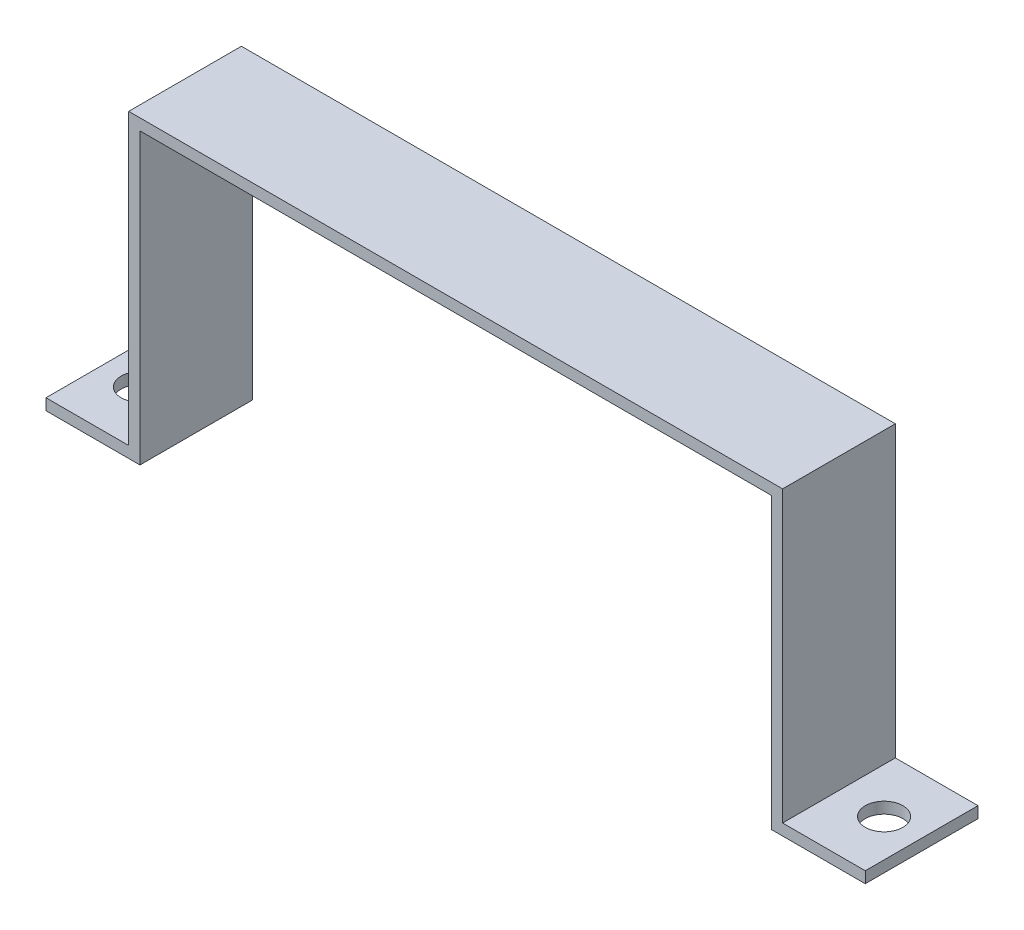
ISO-10303-21;
HEADER;
FILE_DESCRIPTION(('STEP AP214'),'2;1');
FILE_NAME('part.step','',(''),(''),'','','');
FILE_SCHEMA(('AUTOMOTIVE_DESIGN { 1 0 10303 214 1 1 1 1 }'));
ENDSEC;
DATA;
#1=APPLICATION_CONTEXT('core data for automotive mechanical design processes');
#2=APPLICATION_PROTOCOL_DEFINITION('international standard','automotive_design',2000,#1);
#3=PRODUCT_CONTEXT('',#1,'mechanical');
#4=PRODUCT('Part','Part','',(#3));
#5=PRODUCT_RELATED_PRODUCT_CATEGORY('part','',(#4));
#6=PRODUCT_DEFINITION_FORMATION('','',#4);
#7=PRODUCT_DEFINITION_CONTEXT('part definition',#1,'design');
#8=PRODUCT_DEFINITION('design','',#6,#7);
#9=PRODUCT_DEFINITION_SHAPE('','',#8);
#10=(LENGTH_UNIT() NAMED_UNIT(*) SI_UNIT(.MILLI.,.METRE.));
#11=(NAMED_UNIT(*) PLANE_ANGLE_UNIT() SI_UNIT($,.RADIAN.));
#12=(NAMED_UNIT(*) SI_UNIT($,.STERADIAN.) SOLID_ANGLE_UNIT());
#13=UNCERTAINTY_MEASURE_WITH_UNIT(LENGTH_MEASURE(1.E-05),#10,'distance_accuracy_value','');
#14=(GEOMETRIC_REPRESENTATION_CONTEXT(3) GLOBAL_UNCERTAINTY_ASSIGNED_CONTEXT((#13)) GLOBAL_UNIT_ASSIGNED_CONTEXT((#10,
#11,#12)) REPRESENTATION_CONTEXT('',''));
#15=CARTESIAN_POINT('',(0.,0.,0.));
#16=DIRECTION('',(0.,0.,1.));
#17=DIRECTION('',(1.,0.,0.));
#18=AXIS2_PLACEMENT_3D('',#15,#16,#17);
#19=CARTESIAN_POINT('',(-109.,0.,30.));
#20=DIRECTION('',(0.,1.,0.));
#21=DIRECTION('',(0.,0.,1.));
#22=AXIS2_PLACEMENT_3D('',#19,#20,#21);
#23=PLANE('',#22);
#24=CARTESIAN_POINT('',(-99.,0.,15.));
#25=DIRECTION('',(0.,1.,0.));
#26=DIRECTION('',(0.,0.,1.));
#27=AXIS2_PLACEMENT_3D('',#24,#25,#26);
#28=CIRCLE('',#27,5.);
#29=CARTESIAN_POINT('',(-99.,0.,20.));
#30=VERTEX_POINT('',#29);
#31=EDGE_CURVE('E266',#30,#30,#28,.T.);
#32=ORIENTED_EDGE('',*,*,#31,.T.);
#33=EDGE_LOOP('',(#32));
#34=FACE_BOUND('',#33,.T.);
#35=DIRECTION('',(1.,0.,0.));
#36=VECTOR('',#35,1.);
#37=CARTESIAN_POINT('',(-109.,0.,0.));
#38=LINE('',#37,#36);
#39=CARTESIAN_POINT('',(-109.,0.,0.));
#40=VERTEX_POINT('',#39);
#41=CARTESIAN_POINT('',(-84.,0.,0.));
#42=VERTEX_POINT('',#41);
#43=EDGE_CURVE('E157',#40,#42,#38,.T.);
#44=ORIENTED_EDGE('',*,*,#43,.T.);
#45=DIRECTION('',(0.,0.,-1.));
#46=VECTOR('',#45,1.);
#47=CARTESIAN_POINT('',(-84.,0.,30.));
#48=LINE('',#47,#46);
#49=CARTESIAN_POINT('',(-84.,0.,30.));
#50=VERTEX_POINT('',#49);
#51=EDGE_CURVE('E11',#50,#42,#48,.T.);
#52=ORIENTED_EDGE('',*,*,#51,.F.);
#53=DIRECTION('',(1.,0.,0.));
#54=VECTOR('',#53,1.);
#55=CARTESIAN_POINT('',(-109.,0.,30.));
#56=LINE('',#55,#54);
#57=CARTESIAN_POINT('',(-109.,0.,30.));
#58=VERTEX_POINT('',#57);
#59=EDGE_CURVE('E180',#58,#50,#56,.T.);
#60=ORIENTED_EDGE('',*,*,#59,.F.);
#61=DIRECTION('',(0.,0.,-1.));
#62=VECTOR('',#61,1.);
#63=CARTESIAN_POINT('',(-109.,0.,30.));
#64=LINE('',#63,#62);
#65=EDGE_CURVE('E153',#58,#40,#64,.T.);
#66=ORIENTED_EDGE('',*,*,#65,.T.);
#67=EDGE_LOOP('',(#44,#52,#60,#66));
#68=FACE_BOUND('',#67,.T.);
#69=ADVANCED_FACE('F37',(#34,#68),#23,.F.);
#70=CARTESIAN_POINT('',(-84.,0.,30.));
#71=DIRECTION('',(-1.,0.,0.));
#72=DIRECTION('',(0.,0.,1.));
#73=AXIS2_PLACEMENT_3D('',#70,#71,#72);
#74=PLANE('',#73);
#75=DIRECTION('',(0.,1.,0.));
#76=VECTOR('',#75,1.);
#77=CARTESIAN_POINT('',(-84.,0.,0.));
#78=LINE('',#77,#76);
#79=CARTESIAN_POINT('',(-84.,77.,0.));
#80=VERTEX_POINT('',#79);
#81=EDGE_CURVE('E160',#42,#80,#78,.T.);
#82=ORIENTED_EDGE('',*,*,#81,.T.);
#83=DIRECTION('',(0.,0.,-1.));
#84=VECTOR('',#83,1.);
#85=CARTESIAN_POINT('',(-84.,77.,30.));
#86=LINE('',#85,#84);
#87=CARTESIAN_POINT('',(-84.,77.,30.));
#88=VERTEX_POINT('',#87);
#89=EDGE_CURVE('E45',#88,#80,#86,.T.);
#90=ORIENTED_EDGE('',*,*,#89,.F.);
#91=DIRECTION('',(0.,1.,0.));
#92=VECTOR('',#91,1.);
#93=CARTESIAN_POINT('',(-84.,0.,30.));
#94=LINE('',#93,#92);
#95=EDGE_CURVE('E108',#50,#88,#94,.T.);
#96=ORIENTED_EDGE('',*,*,#95,.F.);
#97=ORIENTED_EDGE('',*,*,#51,.T.);
#98=EDGE_LOOP('',(#82,#90,#96,#97));
#99=FACE_BOUND('',#98,.T.);
#100=ADVANCED_FACE('F259',(#99),#74,.F.);
#101=CARTESIAN_POINT('',(-84.,77.,30.));
#102=DIRECTION('',(0.,1.,0.));
#103=DIRECTION('',(0.,0.,1.));
#104=AXIS2_PLACEMENT_3D('',#101,#102,#103);
#105=PLANE('',#104);
#106=DIRECTION('',(1.,0.,0.));
#107=VECTOR('',#106,1.);
#108=CARTESIAN_POINT('',(-84.,77.,0.));
#109=LINE('',#108,#107);
#110=CARTESIAN_POINT('',(84.,77.,0.));
#111=VERTEX_POINT('',#110);
#112=EDGE_CURVE('E163',#80,#111,#109,.T.);
#113=ORIENTED_EDGE('',*,*,#112,.T.);
#114=DIRECTION('',(0.,0.,-1.));
#115=VECTOR('',#114,1.);
#116=CARTESIAN_POINT('',(84.,77.,30.));
#117=LINE('',#116,#115);
#118=CARTESIAN_POINT('',(84.,77.,30.));
#119=VERTEX_POINT('',#118);
#120=EDGE_CURVE('E199',#119,#111,#117,.T.);
#121=ORIENTED_EDGE('',*,*,#120,.F.);
#122=DIRECTION('',(1.,0.,0.));
#123=VECTOR('',#122,1.);
#124=CARTESIAN_POINT('',(-84.,77.,30.));
#125=LINE('',#124,#123);
#126=EDGE_CURVE('E207',#88,#119,#125,.T.);
#127=ORIENTED_EDGE('',*,*,#126,.F.);
#128=ORIENTED_EDGE('',*,*,#89,.T.);
#129=EDGE_LOOP('',(#113,#121,#127,#128));
#130=FACE_BOUND('',#129,.T.);
#131=ADVANCED_FACE('F205',(#130),#105,.F.);
#132=CARTESIAN_POINT('',(84.,77.,30.));
#133=DIRECTION('',(1.,0.,0.));
#134=DIRECTION('',(0.,1.,0.));
#135=AXIS2_PLACEMENT_3D('',#132,#133,#134);
#136=PLANE('',#135);
#137=DIRECTION('',(0.,-1.,0.));
#138=VECTOR('',#137,1.);
#139=CARTESIAN_POINT('',(84.,77.,0.));
#140=LINE('',#139,#138);
#141=CARTESIAN_POINT('',(84.,0.,0.));
#142=VERTEX_POINT('',#141);
#143=EDGE_CURVE('E165',#111,#142,#140,.T.);
#144=ORIENTED_EDGE('',*,*,#143,.T.);
#145=DIRECTION('',(0.,0.,-1.));
#146=VECTOR('',#145,1.);
#147=CARTESIAN_POINT('',(84.,0.,30.));
#148=LINE('',#147,#146);
#149=CARTESIAN_POINT('',(84.,0.,30.));
#150=VERTEX_POINT('',#149);
#151=EDGE_CURVE('E196',#150,#142,#148,.T.);
#152=ORIENTED_EDGE('',*,*,#151,.F.);
#153=DIRECTION('',(0.,-1.,0.));
#154=VECTOR('',#153,1.);
#155=CARTESIAN_POINT('',(84.,77.,30.));
#156=LINE('',#155,#154);
#157=EDGE_CURVE('E225',#119,#150,#156,.T.);
#158=ORIENTED_EDGE('',*,*,#157,.F.);
#159=ORIENTED_EDGE('',*,*,#120,.T.);
#160=EDGE_LOOP('',(#144,#152,#158,#159));
#161=FACE_BOUND('',#160,.T.);
#162=ADVANCED_FACE('F216',(#161),#136,.F.);
#163=CARTESIAN_POINT('',(84.,0.,30.));
#164=DIRECTION('',(0.,1.,0.));
#165=DIRECTION('',(0.,0.,1.));
#166=AXIS2_PLACEMENT_3D('',#163,#164,#165);
#167=PLANE('',#166);
#168=CARTESIAN_POINT('',(99.,0.,15.));
#169=DIRECTION('',(0.,1.,0.));
#170=DIRECTION('',(0.,0.,1.));
#171=AXIS2_PLACEMENT_3D('',#168,#169,#170);
#172=CIRCLE('',#171,5.00000000000002);
#173=CARTESIAN_POINT('',(99.,0.,20.));
#174=VERTEX_POINT('',#173);
#175=EDGE_CURVE('E161',#174,#174,#172,.T.);
#176=ORIENTED_EDGE('',*,*,#175,.T.);
#177=EDGE_LOOP('',(#176));
#178=FACE_BOUND('',#177,.T.);
#179=DIRECTION('',(1.,0.,0.));
#180=VECTOR('',#179,1.);
#181=CARTESIAN_POINT('',(84.,0.,0.));
#182=LINE('',#181,#180);
#183=CARTESIAN_POINT('',(109.,0.,0.));
#184=VERTEX_POINT('',#183);
#185=EDGE_CURVE('E167',#142,#184,#182,.T.);
#186=ORIENTED_EDGE('',*,*,#185,.T.);
#187=DIRECTION('',(0.,0.,-1.));
#188=VECTOR('',#187,1.);
#189=CARTESIAN_POINT('',(109.,0.,30.));
#190=LINE('',#189,#188);
#191=CARTESIAN_POINT('',(109.,0.,30.));
#192=VERTEX_POINT('',#191);
#193=EDGE_CURVE('E193',#192,#184,#190,.T.);
#194=ORIENTED_EDGE('',*,*,#193,.F.);
#195=DIRECTION('',(1.,0.,0.));
#196=VECTOR('',#195,1.);
#197=CARTESIAN_POINT('',(84.,0.,30.));
#198=LINE('',#197,#196);
#199=EDGE_CURVE('E222',#150,#192,#198,.T.);
#200=ORIENTED_EDGE('',*,*,#199,.F.);
#201=ORIENTED_EDGE('',*,*,#151,.T.);
#202=EDGE_LOOP('',(#186,#194,#200,#201));
#203=FACE_BOUND('',#202,.T.);
#204=ADVANCED_FACE('F220',(#178,#203),#167,.F.);
#205=CARTESIAN_POINT('',(109.,0.,30.));
#206=DIRECTION('',(-1.,0.,0.));
#207=DIRECTION('',(0.,0.,1.));
#208=AXIS2_PLACEMENT_3D('',#205,#206,#207);
#209=PLANE('',#208);
#210=DIRECTION('',(0.,1.,0.));
#211=VECTOR('',#210,1.);
#212=CARTESIAN_POINT('',(109.,0.,0.));
#213=LINE('',#212,#211);
#214=CARTESIAN_POINT('',(109.,3.,0.));
#215=VERTEX_POINT('',#214);
#216=EDGE_CURVE('E169',#184,#215,#213,.T.);
#217=ORIENTED_EDGE('',*,*,#216,.T.);
#218=DIRECTION('',(0.,0.,-1.));
#219=VECTOR('',#218,1.);
#220=CARTESIAN_POINT('',(109.,3.,30.));
#221=LINE('',#220,#219);
#222=CARTESIAN_POINT('',(109.,3.,30.));
#223=VERTEX_POINT('',#222);
#224=EDGE_CURVE('E190',#223,#215,#221,.T.);
#225=ORIENTED_EDGE('',*,*,#224,.F.);
#226=DIRECTION('',(0.,1.,0.));
#227=VECTOR('',#226,1.);
#228=CARTESIAN_POINT('',(109.,0.,30.));
#229=LINE('',#228,#227);
#230=EDGE_CURVE('E224',#192,#223,#229,.T.);
#231=ORIENTED_EDGE('',*,*,#230,.F.);
#232=ORIENTED_EDGE('',*,*,#193,.T.);
#233=EDGE_LOOP('',(#217,#225,#231,#232));
#234=FACE_BOUND('',#233,.T.);
#235=ADVANCED_FACE('F287',(#234),#209,.F.);
#236=CARTESIAN_POINT('',(109.,3.,30.));
#237=DIRECTION('',(0.,-1.,0.));
#238=DIRECTION('',(1.,0.,0.));
#239=AXIS2_PLACEMENT_3D('',#236,#237,#238);
#240=PLANE('',#239);
#241=CARTESIAN_POINT('',(99.,3.00000000000002,15.));
#242=DIRECTION('',(0.,1.,0.));
#243=DIRECTION('',(-1.,0.,0.));
#244=AXIS2_PLACEMENT_3D('',#241,#242,#243);
#245=CIRCLE('',#244,5.00000000000002);
#246=CARTESIAN_POINT('',(94.,3.00000000000002,15.));
#247=VERTEX_POINT('',#246);
#248=EDGE_CURVE('E273',#247,#247,#245,.T.);
#249=ORIENTED_EDGE('',*,*,#248,.F.);
#250=EDGE_LOOP('',(#249));
#251=FACE_BOUND('',#250,.T.);
#252=DIRECTION('',(-1.,0.,0.));
#253=VECTOR('',#252,1.);
#254=CARTESIAN_POINT('',(109.,3.,0.));
#255=LINE('',#254,#253);
#256=CARTESIAN_POINT('',(87.,3.,0.));
#257=VERTEX_POINT('',#256);
#258=EDGE_CURVE('E171',#215,#257,#255,.T.);
#259=ORIENTED_EDGE('',*,*,#258,.T.);
#260=DIRECTION('',(0.,0.,-1.));
#261=VECTOR('',#260,1.);
#262=CARTESIAN_POINT('',(87.,3.,30.));
#263=LINE('',#262,#261);
#264=CARTESIAN_POINT('',(87.,3.,30.));
#265=VERTEX_POINT('',#264);
#266=EDGE_CURVE('E187',#265,#257,#263,.T.);
#267=ORIENTED_EDGE('',*,*,#266,.F.);
#268=DIRECTION('',(-1.,0.,0.));
#269=VECTOR('',#268,1.);
#270=CARTESIAN_POINT('',(109.,3.,30.));
#271=LINE('',#270,#269);
#272=EDGE_CURVE('E227',#223,#265,#271,.T.);
#273=ORIENTED_EDGE('',*,*,#272,.F.);
#274=ORIENTED_EDGE('',*,*,#224,.T.);
#275=EDGE_LOOP('',(#259,#267,#273,#274));
#276=FACE_BOUND('',#275,.T.);
#277=ADVANCED_FACE('F284',(#251,#276),#240,.F.);
#278=CARTESIAN_POINT('',(87.,3.,30.));
#279=DIRECTION('',(-1.,0.,0.));
#280=DIRECTION('',(0.,0.,1.));
#281=AXIS2_PLACEMENT_3D('',#278,#279,#280);
#282=PLANE('',#281);
#283=DIRECTION('',(0.,1.,0.));
#284=VECTOR('',#283,1.);
#285=CARTESIAN_POINT('',(87.,3.,0.));
#286=LINE('',#285,#284);
#287=CARTESIAN_POINT('',(87.,80.,0.));
#288=VERTEX_POINT('',#287);
#289=EDGE_CURVE('E173',#257,#288,#286,.T.);
#290=ORIENTED_EDGE('',*,*,#289,.T.);
#291=DIRECTION('',(0.,0.,-1.));
#292=VECTOR('',#291,1.);
#293=CARTESIAN_POINT('',(87.,80.,30.));
#294=LINE('',#293,#292);
#295=CARTESIAN_POINT('',(87.,80.,30.));
#296=VERTEX_POINT('',#295);
#297=EDGE_CURVE('E184',#296,#288,#294,.T.);
#298=ORIENTED_EDGE('',*,*,#297,.F.);
#299=DIRECTION('',(0.,1.,0.));
#300=VECTOR('',#299,1.);
#301=CARTESIAN_POINT('',(87.,3.,30.));
#302=LINE('',#301,#300);
#303=EDGE_CURVE('E233',#265,#296,#302,.T.);
#304=ORIENTED_EDGE('',*,*,#303,.F.);
#305=ORIENTED_EDGE('',*,*,#266,.T.);
#306=EDGE_LOOP('',(#290,#298,#304,#305));
#307=FACE_BOUND('',#306,.T.);
#308=ADVANCED_FACE('F239',(#307),#282,.F.);
#309=CARTESIAN_POINT('',(87.,80.,30.));
#310=DIRECTION('',(0.,-1.,0.));
#311=DIRECTION('',(1.,0.,0.));
#312=AXIS2_PLACEMENT_3D('',#309,#310,#311);
#313=PLANE('',#312);
#314=DIRECTION('',(-1.,0.,0.));
#315=VECTOR('',#314,1.);
#316=CARTESIAN_POINT('',(87.,80.,0.));
#317=LINE('',#316,#315);
#318=CARTESIAN_POINT('',(-87.,80.,0.));
#319=VERTEX_POINT('',#318);
#320=EDGE_CURVE('E175',#288,#319,#317,.T.);
#321=ORIENTED_EDGE('',*,*,#320,.T.);
#322=DIRECTION('',(0.,0.,-1.));
#323=VECTOR('',#322,1.);
#324=CARTESIAN_POINT('',(-87.,80.,30.));
#325=LINE('',#324,#323);
#326=CARTESIAN_POINT('',(-87.,80.,30.));
#327=VERTEX_POINT('',#326);
#328=EDGE_CURVE('E148',#327,#319,#325,.T.);
#329=ORIENTED_EDGE('',*,*,#328,.F.);
#330=DIRECTION('',(-1.,0.,0.));
#331=VECTOR('',#330,1.);
#332=CARTESIAN_POINT('',(87.,80.,30.));
#333=LINE('',#332,#331);
#334=EDGE_CURVE('E139',#296,#327,#333,.T.);
#335=ORIENTED_EDGE('',*,*,#334,.F.);
#336=ORIENTED_EDGE('',*,*,#297,.T.);
#337=EDGE_LOOP('',(#321,#329,#335,#336));
#338=FACE_BOUND('',#337,.T.);
#339=ADVANCED_FACE('F243',(#338),#313,.F.);
#340=CARTESIAN_POINT('',(-87.,80.,30.));
#341=DIRECTION('',(1.,0.,0.));
#342=DIRECTION('',(0.,1.,0.));
#343=AXIS2_PLACEMENT_3D('',#340,#341,#342);
#344=PLANE('',#343);
#345=DIRECTION('',(0.,-1.,0.));
#346=VECTOR('',#345,1.);
#347=CARTESIAN_POINT('',(-87.,80.,0.));
#348=LINE('',#347,#346);
#349=CARTESIAN_POINT('',(-87.,3.,0.));
#350=VERTEX_POINT('',#349);
#351=EDGE_CURVE('E147',#319,#350,#348,.T.);
#352=ORIENTED_EDGE('',*,*,#351,.T.);
#353=DIRECTION('',(0.,0.,-1.));
#354=VECTOR('',#353,1.);
#355=CARTESIAN_POINT('',(-87.,3.,30.));
#356=LINE('',#355,#354);
#357=CARTESIAN_POINT('',(-87.,3.,30.));
#358=VERTEX_POINT('',#357);
#359=EDGE_CURVE('E144',#358,#350,#356,.T.);
#360=ORIENTED_EDGE('',*,*,#359,.F.);
#361=DIRECTION('',(0.,-1.,0.));
#362=VECTOR('',#361,1.);
#363=CARTESIAN_POINT('',(-87.,80.,30.));
#364=LINE('',#363,#362);
#365=EDGE_CURVE('E133',#327,#358,#364,.T.);
#366=ORIENTED_EDGE('',*,*,#365,.F.);
#367=ORIENTED_EDGE('',*,*,#328,.T.);
#368=EDGE_LOOP('',(#352,#360,#366,#367));
#369=FACE_BOUND('',#368,.T.);
#370=ADVANCED_FACE('F145',(#369),#344,.F.);
#371=CARTESIAN_POINT('',(-87.,3.,30.));
#372=DIRECTION('',(0.,-1.,0.));
#373=DIRECTION('',(1.,0.,0.));
#374=AXIS2_PLACEMENT_3D('',#371,#372,#373);
#375=PLANE('',#374);
#376=CARTESIAN_POINT('',(-99.,3.,15.));
#377=DIRECTION('',(0.,1.,0.));
#378=DIRECTION('',(-1.,0.,0.));
#379=AXIS2_PLACEMENT_3D('',#376,#377,#378);
#380=CIRCLE('',#379,5.);
#381=CARTESIAN_POINT('',(-104.,3.,15.));
#382=VERTEX_POINT('',#381);
#383=EDGE_CURVE('E268',#382,#382,#380,.T.);
#384=ORIENTED_EDGE('',*,*,#383,.F.);
#385=EDGE_LOOP('',(#384));
#386=FACE_BOUND('',#385,.T.);
#387=DIRECTION('',(-1.,0.,0.));
#388=VECTOR('',#387,1.);
#389=CARTESIAN_POINT('',(-87.,3.,0.));
#390=LINE('',#389,#388);
#391=CARTESIAN_POINT('',(-109.,3.,0.));
#392=VERTEX_POINT('',#391);
#393=EDGE_CURVE('E94',#350,#392,#390,.T.);
#394=ORIENTED_EDGE('',*,*,#393,.T.);
#395=DIRECTION('',(0.,0.,-1.));
#396=VECTOR('',#395,1.);
#397=CARTESIAN_POINT('',(-109.,3.,30.));
#398=LINE('',#397,#396);
#399=CARTESIAN_POINT('',(-109.,3.,30.));
#400=VERTEX_POINT('',#399);
#401=EDGE_CURVE('E149',#400,#392,#398,.T.);
#402=ORIENTED_EDGE('',*,*,#401,.F.);
#403=DIRECTION('',(-1.,0.,0.));
#404=VECTOR('',#403,1.);
#405=CARTESIAN_POINT('',(-87.,3.,30.));
#406=LINE('',#405,#404);
#407=EDGE_CURVE('E137',#358,#400,#406,.T.);
#408=ORIENTED_EDGE('',*,*,#407,.F.);
#409=ORIENTED_EDGE('',*,*,#359,.T.);
#410=EDGE_LOOP('',(#394,#402,#408,#409));
#411=FACE_BOUND('',#410,.T.);
#412=ADVANCED_FACE('F151',(#386,#411),#375,.F.);
#413=CARTESIAN_POINT('',(-109.,3.,30.));
#414=DIRECTION('',(1.,0.,0.));
#415=DIRECTION('',(0.,0.,-1.));
#416=AXIS2_PLACEMENT_3D('',#413,#414,#415);
#417=PLANE('',#416);
#418=DIRECTION('',(0.,-1.,0.));
#419=VECTOR('',#418,1.);
#420=CARTESIAN_POINT('',(-109.,3.,0.));
#421=LINE('',#420,#419);
#422=EDGE_CURVE('E100',#392,#40,#421,.T.);
#423=ORIENTED_EDGE('',*,*,#422,.T.);
#424=ORIENTED_EDGE('',*,*,#65,.F.);
#425=DIRECTION('',(0.,-1.,0.));
#426=VECTOR('',#425,1.);
#427=CARTESIAN_POINT('',(-109.,3.,30.));
#428=LINE('',#427,#426);
#429=EDGE_CURVE('E53',#400,#58,#428,.T.);
#430=ORIENTED_EDGE('',*,*,#429,.F.);
#431=ORIENTED_EDGE('',*,*,#401,.T.);
#432=EDGE_LOOP('',(#423,#424,#430,#431));
#433=FACE_BOUND('',#432,.T.);
#434=ADVANCED_FACE('F247',(#433),#417,.F.);
#435=CARTESIAN_POINT('',(0.,0.,30.));
#436=DIRECTION('',(0.,0.,1.));
#437=DIRECTION('',(1.,0.,0.));
#438=AXIS2_PLACEMENT_3D('',#435,#436,#437);
#439=PLANE('',#438);
#440=ORIENTED_EDGE('',*,*,#59,.T.);
#441=ORIENTED_EDGE('',*,*,#95,.T.);
#442=ORIENTED_EDGE('',*,*,#126,.T.);
#443=ORIENTED_EDGE('',*,*,#157,.T.);
#444=ORIENTED_EDGE('',*,*,#199,.T.);
#445=ORIENTED_EDGE('',*,*,#230,.T.);
#446=ORIENTED_EDGE('',*,*,#272,.T.);
#447=ORIENTED_EDGE('',*,*,#303,.T.);
#448=ORIENTED_EDGE('',*,*,#334,.T.);
#449=ORIENTED_EDGE('',*,*,#365,.T.);
#450=ORIENTED_EDGE('',*,*,#407,.T.);
#451=ORIENTED_EDGE('',*,*,#429,.T.);
#452=EDGE_LOOP('',(#440,#441,#442,#443,#444,#445,#446,#447,#448,#449,#450,#451));
#453=FACE_BOUND('',#452,.T.);
#454=ADVANCED_FACE('F135',(#453),#439,.T.);
#455=CARTESIAN_POINT('',(0.,0.,0.));
#456=DIRECTION('',(0.,0.,1.));
#457=DIRECTION('',(1.,0.,0.));
#458=AXIS2_PLACEMENT_3D('',#455,#456,#457);
#459=PLANE('',#458);
#460=ORIENTED_EDGE('',*,*,#43,.F.);
#461=ORIENTED_EDGE('',*,*,#422,.F.);
#462=ORIENTED_EDGE('',*,*,#393,.F.);
#463=ORIENTED_EDGE('',*,*,#351,.F.);
#464=ORIENTED_EDGE('',*,*,#320,.F.);
#465=ORIENTED_EDGE('',*,*,#289,.F.);
#466=ORIENTED_EDGE('',*,*,#258,.F.);
#467=ORIENTED_EDGE('',*,*,#216,.F.);
#468=ORIENTED_EDGE('',*,*,#185,.F.);
#469=ORIENTED_EDGE('',*,*,#143,.F.);
#470=ORIENTED_EDGE('',*,*,#112,.F.);
#471=ORIENTED_EDGE('',*,*,#81,.F.);
#472=EDGE_LOOP('',(#460,#461,#462,#463,#464,#465,#466,#467,#468,#469,#470,#471));
#473=FACE_BOUND('',#472,.T.);
#474=ADVANCED_FACE('F211',(#473),#459,.F.);
#475=CARTESIAN_POINT('',(-99.,-27.,15.));
#476=DIRECTION('',(0.,1.,0.));
#477=DIRECTION('',(-1.,0.,0.));
#478=AXIS2_PLACEMENT_3D('',#475,#476,#477);
#479=CYLINDRICAL_SURFACE('',#478,5.);
#480=ORIENTED_EDGE('',*,*,#383,.T.);
#481=EDGE_LOOP('',(#480));
#482=FACE_BOUND('',#481,.T.);
#483=ORIENTED_EDGE('',*,*,#31,.F.);
#484=EDGE_LOOP('',(#483));
#485=FACE_BOUND('',#484,.T.);
#486=ADVANCED_FACE('F342',(#482,#485),#479,.F.);
#487=CARTESIAN_POINT('',(99.,-27.,15.));
#488=DIRECTION('',(0.,1.,0.));
#489=DIRECTION('',(-1.,0.,0.));
#490=AXIS2_PLACEMENT_3D('',#487,#488,#489);
#491=CYLINDRICAL_SURFACE('',#490,5.00000000000002);
#492=ORIENTED_EDGE('',*,*,#248,.T.);
#493=EDGE_LOOP('',(#492));
#494=FACE_BOUND('',#493,.T.);
#495=ORIENTED_EDGE('',*,*,#175,.F.);
#496=EDGE_LOOP('',(#495));
#497=FACE_BOUND('',#496,.T.);
#498=ADVANCED_FACE('F281',(#494,#497),#491,.F.);
#499=CLOSED_SHELL('',(#69,#100,#131,#162,#204,#235,#277,#308,#339,#370,#412,#434,#454,#474,#486,#498));
#500=MANIFOLD_SOLID_BREP('B2',#499);
#501=ADVANCED_BREP_SHAPE_REPRESENTATION('',(#18,#500),#14);
#502=SHAPE_DEFINITION_REPRESENTATION(#9,#501);
ENDSEC;
END-ISO-10303-21;
